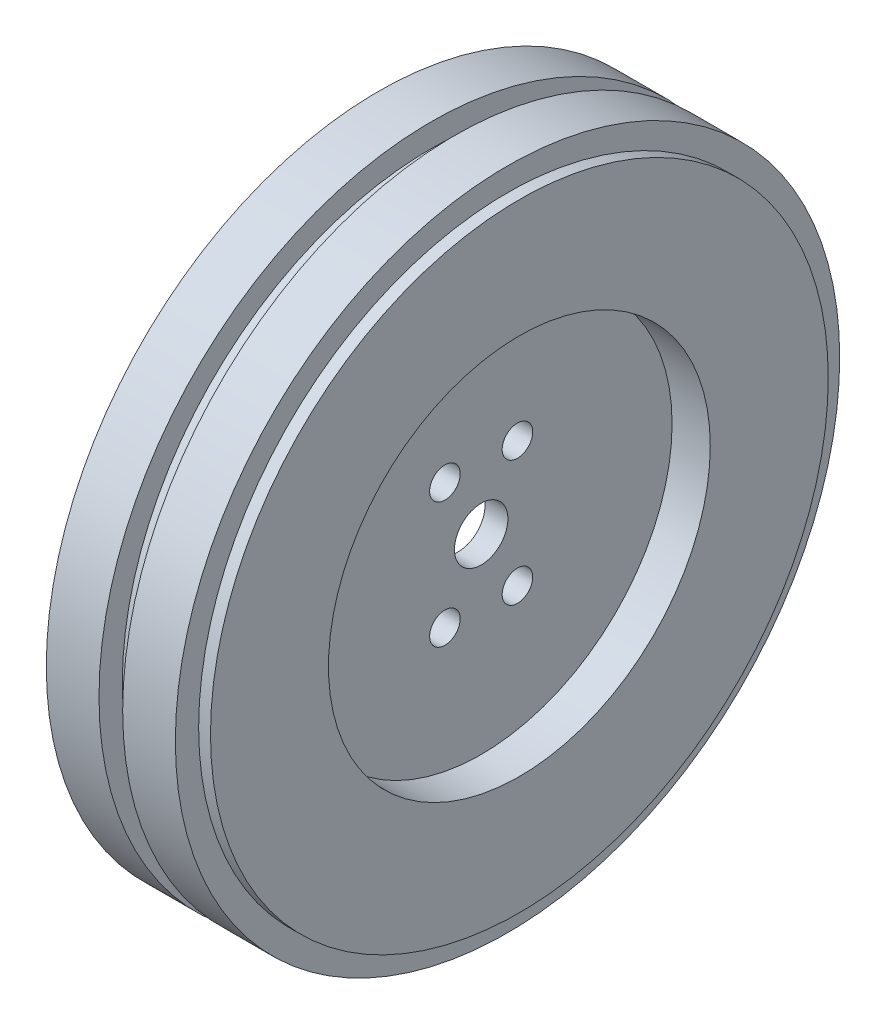
ISO-10303-21;
HEADER;
FILE_DESCRIPTION(('STEP AP214'),'2;1');
FILE_NAME('part.step','',(''),(''),'','','');
FILE_SCHEMA(('AUTOMOTIVE_DESIGN { 1 0 10303 214 1 1 1 1 }'));
ENDSEC;
DATA;
#1=APPLICATION_CONTEXT('core data for automotive mechanical design processes');
#2=APPLICATION_PROTOCOL_DEFINITION('international standard','automotive_design',2000,#1);
#3=PRODUCT_CONTEXT('',#1,'mechanical');
#4=PRODUCT('Part','Part','',(#3));
#5=PRODUCT_RELATED_PRODUCT_CATEGORY('part','',(#4));
#6=PRODUCT_DEFINITION_FORMATION('','',#4);
#7=PRODUCT_DEFINITION_CONTEXT('part definition',#1,'design');
#8=PRODUCT_DEFINITION('design','',#6,#7);
#9=PRODUCT_DEFINITION_SHAPE('','',#8);
#10=(LENGTH_UNIT() NAMED_UNIT(*) SI_UNIT(.MILLI.,.METRE.));
#11=(NAMED_UNIT(*) PLANE_ANGLE_UNIT() SI_UNIT($,.RADIAN.));
#12=(NAMED_UNIT(*) SI_UNIT($,.STERADIAN.) SOLID_ANGLE_UNIT());
#13=UNCERTAINTY_MEASURE_WITH_UNIT(LENGTH_MEASURE(1.E-05),#10,'distance_accuracy_value','');
#14=(GEOMETRIC_REPRESENTATION_CONTEXT(3) GLOBAL_UNCERTAINTY_ASSIGNED_CONTEXT((#13)) GLOBAL_UNIT_ASSIGNED_CONTEXT((#10,
#11,#12)) REPRESENTATION_CONTEXT('',''));
#15=CARTESIAN_POINT('',(0.,0.,0.));
#16=DIRECTION('',(0.,0.,1.));
#17=DIRECTION('',(1.,0.,0.));
#18=AXIS2_PLACEMENT_3D('',#15,#16,#17);
#19=CARTESIAN_POINT('',(8.00000000000001,0.,0.));
#20=DIRECTION('',(-1.,0.,0.));
#21=DIRECTION('',(0.,0.,1.));
#22=AXIS2_PLACEMENT_3D('',#19,#20,#21);
#23=CYLINDRICAL_SURFACE('',#22,43.5);
#24=CARTESIAN_POINT('',(-0.449999999999995,0.,0.));
#25=DIRECTION('',(-1.,0.,0.));
#26=DIRECTION('',(0.,0.,1.));
#27=AXIS2_PLACEMENT_3D('',#24,#25,#26);
#28=CIRCLE('',#27,43.5);
#29=CARTESIAN_POINT('',(-0.449999999999995,0.,43.5));
#30=VERTEX_POINT('',#29);
#31=EDGE_CURVE('E96',#30,#30,#28,.T.);
#32=ORIENTED_EDGE('',*,*,#31,.F.);
#33=EDGE_LOOP('',(#32));
#34=FACE_BOUND('',#33,.T.);
#35=CARTESIAN_POINT('',(6.45,0.,0.));
#36=DIRECTION('',(1.,0.,0.));
#37=DIRECTION('',(0.,0.,-1.));
#38=AXIS2_PLACEMENT_3D('',#35,#36,#37);
#39=CIRCLE('',#38,43.5);
#40=CARTESIAN_POINT('',(6.45,0.,-43.5));
#41=VERTEX_POINT('',#40);
#42=EDGE_CURVE('E102',#41,#41,#39,.T.);
#43=ORIENTED_EDGE('',*,*,#42,.F.);
#44=EDGE_LOOP('',(#43));
#45=FACE_BOUND('',#44,.T.);
#46=ADVANCED_FACE('F31',(#34,#45),#23,.T.);
#47=CARTESIAN_POINT('',(8.,40.,0.));
#48=DIRECTION('',(-1.,0.,0.));
#49=DIRECTION('',(0.,0.,1.));
#50=AXIS2_PLACEMENT_3D('',#47,#48,#49);
#51=PLANE('',#50);
#52=CARTESIAN_POINT('',(8.,0.,0.));
#53=DIRECTION('',(1.,0.,0.));
#54=DIRECTION('',(0.,0.,-1.));
#55=AXIS2_PLACEMENT_3D('',#52,#53,#54);
#56=CIRCLE('',#55,25.);
#57=CARTESIAN_POINT('',(8.,0.,-25.));
#58=VERTEX_POINT('',#57);
#59=EDGE_CURVE('E76',#58,#58,#56,.T.);
#60=ORIENTED_EDGE('',*,*,#59,.F.);
#61=EDGE_LOOP('',(#60));
#62=FACE_BOUND('',#61,.T.);
#63=CARTESIAN_POINT('',(8.,0.,0.));
#64=DIRECTION('',(1.,0.,0.));
#65=DIRECTION('',(0.,0.,-1.));
#66=AXIS2_PLACEMENT_3D('',#63,#64,#65);
#67=CIRCLE('',#66,40.45);
#68=CARTESIAN_POINT('',(8.,0.,-40.45));
#69=VERTEX_POINT('',#68);
#70=EDGE_CURVE('E106',#69,#69,#67,.T.);
#71=ORIENTED_EDGE('',*,*,#70,.T.);
#72=EDGE_LOOP('',(#71));
#73=FACE_BOUND('',#72,.T.);
#74=ADVANCED_FACE('F123',(#62,#73),#51,.F.);
#75=CARTESIAN_POINT('',(-12.,0.,0.));
#76=DIRECTION('',(-1.,0.,0.));
#77=DIRECTION('',(0.,0.,1.));
#78=AXIS2_PLACEMENT_3D('',#75,#76,#77);
#79=PLANE('',#78);
#80=CARTESIAN_POINT('',(-12.,0.,0.));
#81=DIRECTION('',(-1.,0.,0.));
#82=DIRECTION('',(0.,0.,1.));
#83=AXIS2_PLACEMENT_3D('',#80,#81,#82);
#84=CIRCLE('',#83,34.);
#85=CARTESIAN_POINT('',(-12.,0.,34.));
#86=VERTEX_POINT('',#85);
#87=EDGE_CURVE('E72',#86,#86,#84,.F.);
#88=ORIENTED_EDGE('',*,*,#87,.T.);
#89=EDGE_LOOP('',(#88));
#90=FACE_BOUND('',#89,.T.);
#91=CARTESIAN_POINT('',(-12.,0.,0.));
#92=DIRECTION('',(-1.,0.,0.));
#93=DIRECTION('',(0.,0.,1.));
#94=AXIS2_PLACEMENT_3D('',#91,#92,#93);
#95=CIRCLE('',#94,40.45);
#96=CARTESIAN_POINT('',(-12.,0.,40.45));
#97=VERTEX_POINT('',#96);
#98=EDGE_CURVE('E85',#97,#97,#95,.T.);
#99=ORIENTED_EDGE('',*,*,#98,.T.);
#100=EDGE_LOOP('',(#99));
#101=FACE_BOUND('',#100,.T.);
#102=ADVANCED_FACE('F130',(#90,#101),#79,.T.);
#103=CARTESIAN_POINT('',(-3.54999999999999,0.,0.));
#104=DIRECTION('',(-1.,0.,0.));
#105=DIRECTION('',(0.,0.,1.));
#106=AXIS2_PLACEMENT_3D('',#103,#104,#105);
#107=CIRCLE('',#106,43.5);
#108=CARTESIAN_POINT('',(-3.54999999999999,0.,43.5));
#109=VERTEX_POINT('',#108);
#110=EDGE_CURVE('E88',#109,#109,#107,.T.);
#111=ORIENTED_EDGE('',*,*,#110,.T.);
#112=EDGE_LOOP('',(#111));
#113=FACE_BOUND('',#112,.T.);
#114=CARTESIAN_POINT('',(-10.45,0.,0.));
#115=DIRECTION('',(-1.,0.,0.));
#116=DIRECTION('',(0.,0.,1.));
#117=AXIS2_PLACEMENT_3D('',#114,#115,#116);
#118=CIRCLE('',#117,43.5);
#119=CARTESIAN_POINT('',(-10.45,0.,43.5));
#120=VERTEX_POINT('',#119);
#121=EDGE_CURVE('E79',#120,#120,#118,.T.);
#122=ORIENTED_EDGE('',*,*,#121,.F.);
#123=EDGE_LOOP('',(#122));
#124=FACE_BOUND('',#123,.T.);
#125=ADVANCED_FACE('F126',(#113,#124),#23,.T.);
#126=CARTESIAN_POINT('',(-49.6444990272902,0.,0.));
#127=DIRECTION('',(-1.,0.,0.));
#128=DIRECTION('',(0.,0.,1.));
#129=AXIS2_PLACEMENT_3D('',#126,#127,#128);
#130=CYLINDRICAL_SURFACE('',#129,34.);
#131=CARTESIAN_POINT('',(0.,0.,0.));
#132=DIRECTION('',(-1.,0.,0.));
#133=DIRECTION('',(0.,0.,1.));
#134=AXIS2_PLACEMENT_3D('',#131,#132,#133);
#135=CIRCLE('',#134,34.);
#136=CARTESIAN_POINT('',(0.,0.,34.));
#137=VERTEX_POINT('',#136);
#138=EDGE_CURVE('E10',#137,#137,#135,.T.);
#139=ORIENTED_EDGE('',*,*,#138,.F.);
#140=EDGE_LOOP('',(#139));
#141=FACE_BOUND('',#140,.T.);
#142=ORIENTED_EDGE('',*,*,#87,.F.);
#143=EDGE_LOOP('',(#142));
#144=FACE_BOUND('',#143,.T.);
#145=ADVANCED_FACE('F33',(#141,#144),#130,.F.);
#146=CARTESIAN_POINT('',(0.,34.,0.));
#147=DIRECTION('',(1.,0.,0.));
#148=DIRECTION('',(0.,0.,-1.));
#149=AXIS2_PLACEMENT_3D('',#146,#147,#148);
#150=PLANE('',#149);
#151=CARTESIAN_POINT('',(0.,0.,0.));
#152=DIRECTION('',(1.,0.,0.));
#153=DIRECTION('',(0.,0.,-1.));
#154=AXIS2_PLACEMENT_3D('',#151,#152,#153);
#155=CIRCLE('',#154,3.5);
#156=CARTESIAN_POINT('',(0.,0.,-3.5));
#157=VERTEX_POINT('',#156);
#158=EDGE_CURVE('E66',#157,#157,#155,.T.);
#159=ORIENTED_EDGE('',*,*,#158,.T.);
#160=EDGE_LOOP('',(#159));
#161=FACE_BOUND('',#160,.T.);
#162=CARTESIAN_POINT('',(0.,8.22724133595216,4.75000000000001));
#163=DIRECTION('',(1.,0.,0.));
#164=DIRECTION('',(0.,0.,-1.));
#165=AXIS2_PLACEMENT_3D('',#162,#163,#164);
#166=CIRCLE('',#165,2.);
#167=CARTESIAN_POINT('',(0.,8.22724133595216,2.75000000000001));
#168=VERTEX_POINT('',#167);
#169=EDGE_CURVE('E38',#168,#168,#166,.T.);
#170=ORIENTED_EDGE('',*,*,#169,.T.);
#171=EDGE_LOOP('',(#170));
#172=FACE_BOUND('',#171,.T.);
#173=CARTESIAN_POINT('',(0.,-8.22724133595216,-4.75000000000001));
#174=DIRECTION('',(1.,0.,0.));
#175=DIRECTION('',(0.,0.,-1.));
#176=AXIS2_PLACEMENT_3D('',#173,#174,#175);
#177=CIRCLE('',#176,2.);
#178=CARTESIAN_POINT('',(0.,-8.22724133595216,-6.75000000000001));
#179=VERTEX_POINT('',#178);
#180=EDGE_CURVE('E42',#179,#179,#177,.T.);
#181=ORIENTED_EDGE('',*,*,#180,.T.);
#182=EDGE_LOOP('',(#181));
#183=FACE_BOUND('',#182,.T.);
#184=CARTESIAN_POINT('',(0.,-8.22724133595216,4.75000000000001));
#185=DIRECTION('',(1.,0.,0.));
#186=DIRECTION('',(0.,0.,-1.));
#187=AXIS2_PLACEMENT_3D('',#184,#185,#186);
#188=CIRCLE('',#187,2.);
#189=CARTESIAN_POINT('',(0.,-8.22724133595216,2.75000000000001));
#190=VERTEX_POINT('',#189);
#191=EDGE_CURVE('E46',#190,#190,#188,.T.);
#192=ORIENTED_EDGE('',*,*,#191,.T.);
#193=EDGE_LOOP('',(#192));
#194=FACE_BOUND('',#193,.T.);
#195=CARTESIAN_POINT('',(0.,8.22724133595216,-4.75000000000001));
#196=DIRECTION('',(1.,0.,0.));
#197=DIRECTION('',(0.,0.,-1.));
#198=AXIS2_PLACEMENT_3D('',#195,#196,#197);
#199=CIRCLE('',#198,2.);
#200=CARTESIAN_POINT('',(0.,8.22724133595216,-6.75000000000001));
#201=VERTEX_POINT('',#200);
#202=EDGE_CURVE('E51',#201,#201,#199,.T.);
#203=ORIENTED_EDGE('',*,*,#202,.T.);
#204=EDGE_LOOP('',(#203));
#205=FACE_BOUND('',#204,.T.);
#206=ORIENTED_EDGE('',*,*,#138,.T.);
#207=EDGE_LOOP('',(#206));
#208=FACE_BOUND('',#207,.T.);
#209=ADVANCED_FACE('F141',(#161,#172,#183,#194,#205,#208),#150,.F.);
#210=CARTESIAN_POINT('',(3.,12.5,0.));
#211=DIRECTION('',(1.,0.,0.));
#212=DIRECTION('',(0.,0.,-1.));
#213=AXIS2_PLACEMENT_3D('',#210,#211,#212);
#214=PLANE('',#213);
#215=CARTESIAN_POINT('',(3.,0.,0.));
#216=DIRECTION('',(1.,0.,0.));
#217=DIRECTION('',(0.,0.,-1.));
#218=AXIS2_PLACEMENT_3D('',#215,#216,#217);
#219=CIRCLE('',#218,3.5);
#220=CARTESIAN_POINT('',(3.,0.,-3.5));
#221=VERTEX_POINT('',#220);
#222=EDGE_CURVE('E69',#221,#221,#219,.T.);
#223=ORIENTED_EDGE('',*,*,#222,.F.);
#224=EDGE_LOOP('',(#223));
#225=FACE_BOUND('',#224,.T.);
#226=CARTESIAN_POINT('',(3.,8.22724133595216,4.75000000000001));
#227=DIRECTION('',(1.,0.,0.));
#228=DIRECTION('',(0.,0.,1.));
#229=AXIS2_PLACEMENT_3D('',#226,#227,#228);
#230=CIRCLE('',#229,2.);
#231=CARTESIAN_POINT('',(3.,8.22724133595216,6.75000000000001));
#232=VERTEX_POINT('',#231);
#233=EDGE_CURVE('E57',#232,#232,#230,.T.);
#234=ORIENTED_EDGE('',*,*,#233,.F.);
#235=EDGE_LOOP('',(#234));
#236=FACE_BOUND('',#235,.T.);
#237=CARTESIAN_POINT('',(3.,-8.22724133595216,-4.75000000000001));
#238=DIRECTION('',(1.,0.,0.));
#239=DIRECTION('',(0.,0.,1.));
#240=AXIS2_PLACEMENT_3D('',#237,#238,#239);
#241=CIRCLE('',#240,2.);
#242=CARTESIAN_POINT('',(3.,-8.22724133595216,-2.75000000000001));
#243=VERTEX_POINT('',#242);
#244=EDGE_CURVE('E58',#243,#243,#241,.T.);
#245=ORIENTED_EDGE('',*,*,#244,.F.);
#246=EDGE_LOOP('',(#245));
#247=FACE_BOUND('',#246,.T.);
#248=CARTESIAN_POINT('',(3.,-8.22724133595216,4.75000000000001));
#249=DIRECTION('',(1.,0.,0.));
#250=DIRECTION('',(0.,0.,-1.));
#251=AXIS2_PLACEMENT_3D('',#248,#249,#250);
#252=CIRCLE('',#251,2.);
#253=CARTESIAN_POINT('',(3.,-8.22724133595216,2.75000000000001));
#254=VERTEX_POINT('',#253);
#255=EDGE_CURVE('E61',#254,#254,#252,.T.);
#256=ORIENTED_EDGE('',*,*,#255,.F.);
#257=EDGE_LOOP('',(#256));
#258=FACE_BOUND('',#257,.T.);
#259=CARTESIAN_POINT('',(3.,8.22724133595216,-4.75000000000001));
#260=DIRECTION('',(1.,0.,0.));
#261=DIRECTION('',(0.,0.,-1.));
#262=AXIS2_PLACEMENT_3D('',#259,#260,#261);
#263=CIRCLE('',#262,2.);
#264=CARTESIAN_POINT('',(3.,8.22724133595216,-6.75000000000001));
#265=VERTEX_POINT('',#264);
#266=EDGE_CURVE('E54',#265,#265,#263,.T.);
#267=ORIENTED_EDGE('',*,*,#266,.F.);
#268=EDGE_LOOP('',(#267));
#269=FACE_BOUND('',#268,.T.);
#270=CARTESIAN_POINT('',(3.,0.,0.));
#271=DIRECTION('',(1.,0.,0.));
#272=DIRECTION('',(0.,0.,-1.));
#273=AXIS2_PLACEMENT_3D('',#270,#271,#272);
#274=CIRCLE('',#273,25.);
#275=CARTESIAN_POINT('',(3.,0.,-25.));
#276=VERTEX_POINT('',#275);
#277=EDGE_CURVE('E75',#276,#276,#274,.T.);
#278=ORIENTED_EDGE('',*,*,#277,.T.);
#279=EDGE_LOOP('',(#278));
#280=FACE_BOUND('',#279,.T.);
#281=ADVANCED_FACE('F232',(#225,#236,#247,#258,#269,#280),#214,.T.);
#282=CARTESIAN_POINT('',(-32.,8.22724133595216,-4.75000000000001));
#283=DIRECTION('',(1.,0.,0.));
#284=DIRECTION('',(0.,0.,-1.));
#285=AXIS2_PLACEMENT_3D('',#282,#283,#284);
#286=CYLINDRICAL_SURFACE('',#285,2.);
#287=ORIENTED_EDGE('',*,*,#266,.T.);
#288=EDGE_LOOP('',(#287));
#289=FACE_BOUND('',#288,.T.);
#290=ORIENTED_EDGE('',*,*,#202,.F.);
#291=EDGE_LOOP('',(#290));
#292=FACE_BOUND('',#291,.T.);
#293=ADVANCED_FACE('F236',(#289,#292),#286,.F.);
#294=CARTESIAN_POINT('',(-32.,-8.22724133595216,4.75000000000001));
#295=DIRECTION('',(1.,0.,0.));
#296=DIRECTION('',(0.,0.,-1.));
#297=AXIS2_PLACEMENT_3D('',#294,#295,#296);
#298=CYLINDRICAL_SURFACE('',#297,2.);
#299=ORIENTED_EDGE('',*,*,#255,.T.);
#300=EDGE_LOOP('',(#299));
#301=FACE_BOUND('',#300,.T.);
#302=ORIENTED_EDGE('',*,*,#191,.F.);
#303=EDGE_LOOP('',(#302));
#304=FACE_BOUND('',#303,.T.);
#305=ADVANCED_FACE('F282',(#301,#304),#298,.F.);
#306=CARTESIAN_POINT('',(-32.,-8.22724133595216,-4.75000000000001));
#307=DIRECTION('',(1.,0.,0.));
#308=DIRECTION('',(0.,0.,-1.));
#309=AXIS2_PLACEMENT_3D('',#306,#307,#308);
#310=CYLINDRICAL_SURFACE('',#309,2.);
#311=ORIENTED_EDGE('',*,*,#244,.T.);
#312=EDGE_LOOP('',(#311));
#313=FACE_BOUND('',#312,.T.);
#314=ORIENTED_EDGE('',*,*,#180,.F.);
#315=EDGE_LOOP('',(#314));
#316=FACE_BOUND('',#315,.T.);
#317=ADVANCED_FACE('F272',(#313,#316),#310,.F.);
#318=CARTESIAN_POINT('',(-32.,8.22724133595216,4.75000000000001));
#319=DIRECTION('',(1.,0.,0.));
#320=DIRECTION('',(0.,0.,-1.));
#321=AXIS2_PLACEMENT_3D('',#318,#319,#320);
#322=CYLINDRICAL_SURFACE('',#321,2.);
#323=ORIENTED_EDGE('',*,*,#233,.T.);
#324=EDGE_LOOP('',(#323));
#325=FACE_BOUND('',#324,.T.);
#326=ORIENTED_EDGE('',*,*,#169,.F.);
#327=EDGE_LOOP('',(#326));
#328=FACE_BOUND('',#327,.T.);
#329=ADVANCED_FACE('F254',(#325,#328),#322,.F.);
#330=CARTESIAN_POINT('',(-32.,0.,0.));
#331=DIRECTION('',(1.,0.,0.));
#332=DIRECTION('',(0.,0.,-1.));
#333=AXIS2_PLACEMENT_3D('',#330,#331,#332);
#334=CYLINDRICAL_SURFACE('',#333,3.5);
#335=ORIENTED_EDGE('',*,*,#222,.T.);
#336=EDGE_LOOP('',(#335));
#337=FACE_BOUND('',#336,.T.);
#338=ORIENTED_EDGE('',*,*,#158,.F.);
#339=EDGE_LOOP('',(#338));
#340=FACE_BOUND('',#339,.T.);
#341=ADVANCED_FACE('F161',(#337,#340),#334,.F.);
#342=CARTESIAN_POINT('',(3.,0.,0.));
#343=DIRECTION('',(1.,0.,0.));
#344=DIRECTION('',(0.,0.,-1.));
#345=AXIS2_PLACEMENT_3D('',#342,#343,#344);
#346=CYLINDRICAL_SURFACE('',#345,25.);
#347=ORIENTED_EDGE('',*,*,#277,.F.);
#348=EDGE_LOOP('',(#347));
#349=FACE_BOUND('',#348,.T.);
#350=ORIENTED_EDGE('',*,*,#59,.T.);
#351=EDGE_LOOP('',(#350));
#352=FACE_BOUND('',#351,.T.);
#353=ADVANCED_FACE('F152',(#349,#352),#346,.F.);
#354=CARTESIAN_POINT('',(-10.45,0.,0.));
#355=DIRECTION('',(-1.,0.,0.));
#356=DIRECTION('',(0.,0.,1.));
#357=AXIS2_PLACEMENT_3D('',#354,#355,#356);
#358=PLANE('',#357);
#359=CARTESIAN_POINT('',(-10.45,0.,0.));
#360=DIRECTION('',(-1.,0.,0.));
#361=DIRECTION('',(0.,0.,1.));
#362=AXIS2_PLACEMENT_3D('',#359,#360,#361);
#363=CIRCLE('',#362,40.45);
#364=CARTESIAN_POINT('',(-10.45,0.,40.45));
#365=VERTEX_POINT('',#364);
#366=EDGE_CURVE('E84',#365,#365,#363,.T.);
#367=ORIENTED_EDGE('',*,*,#366,.F.);
#368=EDGE_LOOP('',(#367));
#369=FACE_BOUND('',#368,.T.);
#370=ORIENTED_EDGE('',*,*,#121,.T.);
#371=EDGE_LOOP('',(#370));
#372=FACE_BOUND('',#371,.T.);
#373=ADVANCED_FACE('F149',(#369,#372),#358,.T.);
#374=CARTESIAN_POINT('',(-10.45,0.,0.));
#375=DIRECTION('',(-1.,0.,0.));
#376=DIRECTION('',(0.,0.,1.));
#377=AXIS2_PLACEMENT_3D('',#374,#375,#376);
#378=CYLINDRICAL_SURFACE('',#377,40.45);
#379=ORIENTED_EDGE('',*,*,#366,.T.);
#380=EDGE_LOOP('',(#379));
#381=FACE_BOUND('',#380,.T.);
#382=ORIENTED_EDGE('',*,*,#98,.F.);
#383=EDGE_LOOP('',(#382));
#384=FACE_BOUND('',#383,.T.);
#385=ADVANCED_FACE('F151',(#381,#384),#378,.T.);
#386=CARTESIAN_POINT('',(-3.54999999999999,0.,0.));
#387=DIRECTION('',(-1.,0.,0.));
#388=DIRECTION('',(0.,0.,1.));
#389=AXIS2_PLACEMENT_3D('',#386,#387,#388);
#390=PLANE('',#389);
#391=ORIENTED_EDGE('',*,*,#110,.F.);
#392=EDGE_LOOP('',(#391));
#393=FACE_BOUND('',#392,.T.);
#394=CARTESIAN_POINT('',(-3.54999999999999,0.,0.));
#395=DIRECTION('',(-1.,0.,0.));
#396=DIRECTION('',(0.,0.,1.));
#397=AXIS2_PLACEMENT_3D('',#394,#395,#396);
#398=CIRCLE('',#397,40.45);
#399=CARTESIAN_POINT('',(-3.54999999999999,0.,40.45));
#400=VERTEX_POINT('',#399);
#401=EDGE_CURVE('E93',#400,#400,#398,.T.);
#402=ORIENTED_EDGE('',*,*,#401,.T.);
#403=EDGE_LOOP('',(#402));
#404=FACE_BOUND('',#403,.T.);
#405=ADVANCED_FACE('F158',(#393,#404),#390,.F.);
#406=CARTESIAN_POINT('',(-3.54999999999999,0.,0.));
#407=DIRECTION('',(1.,0.,0.));
#408=DIRECTION('',(0.,0.,-1.));
#409=AXIS2_PLACEMENT_3D('',#406,#407,#408);
#410=CYLINDRICAL_SURFACE('',#409,40.45);
#411=ORIENTED_EDGE('',*,*,#401,.F.);
#412=EDGE_LOOP('',(#411));
#413=FACE_BOUND('',#412,.T.);
#414=CARTESIAN_POINT('',(-0.449999999999995,0.,0.));
#415=DIRECTION('',(-1.,0.,0.));
#416=DIRECTION('',(0.,0.,1.));
#417=AXIS2_PLACEMENT_3D('',#414,#415,#416);
#418=CIRCLE('',#417,40.45);
#419=CARTESIAN_POINT('',(-0.449999999999995,0.,40.45));
#420=VERTEX_POINT('',#419);
#421=EDGE_CURVE('E99',#420,#420,#418,.T.);
#422=ORIENTED_EDGE('',*,*,#421,.T.);
#423=EDGE_LOOP('',(#422));
#424=FACE_BOUND('',#423,.T.);
#425=ADVANCED_FACE('F167',(#413,#424),#410,.T.);
#426=CARTESIAN_POINT('',(-0.449999999999995,0.,0.));
#427=DIRECTION('',(-1.,0.,0.));
#428=DIRECTION('',(0.,0.,1.));
#429=AXIS2_PLACEMENT_3D('',#426,#427,#428);
#430=PLANE('',#429);
#431=ORIENTED_EDGE('',*,*,#421,.F.);
#432=EDGE_LOOP('',(#431));
#433=FACE_BOUND('',#432,.T.);
#434=ORIENTED_EDGE('',*,*,#31,.T.);
#435=EDGE_LOOP('',(#434));
#436=FACE_BOUND('',#435,.T.);
#437=ADVANCED_FACE('F118',(#433,#436),#430,.T.);
#438=CARTESIAN_POINT('',(6.45,0.,0.));
#439=DIRECTION('',(1.,0.,0.));
#440=DIRECTION('',(0.,0.,-1.));
#441=AXIS2_PLACEMENT_3D('',#438,#439,#440);
#442=PLANE('',#441);
#443=CARTESIAN_POINT('',(6.45,0.,0.));
#444=DIRECTION('',(1.,0.,0.));
#445=DIRECTION('',(0.,0.,-1.));
#446=AXIS2_PLACEMENT_3D('',#443,#444,#445);
#447=CIRCLE('',#446,40.45);
#448=CARTESIAN_POINT('',(6.45,0.,-40.45));
#449=VERTEX_POINT('',#448);
#450=EDGE_CURVE('E105',#449,#449,#447,.T.);
#451=ORIENTED_EDGE('',*,*,#450,.F.);
#452=EDGE_LOOP('',(#451));
#453=FACE_BOUND('',#452,.T.);
#454=ORIENTED_EDGE('',*,*,#42,.T.);
#455=EDGE_LOOP('',(#454));
#456=FACE_BOUND('',#455,.T.);
#457=ADVANCED_FACE('F115',(#453,#456),#442,.T.);
#458=CARTESIAN_POINT('',(6.45,0.,0.));
#459=DIRECTION('',(1.,0.,0.));
#460=DIRECTION('',(0.,0.,-1.));
#461=AXIS2_PLACEMENT_3D('',#458,#459,#460);
#462=CYLINDRICAL_SURFACE('',#461,40.45);
#463=ORIENTED_EDGE('',*,*,#450,.T.);
#464=EDGE_LOOP('',(#463));
#465=FACE_BOUND('',#464,.T.);
#466=ORIENTED_EDGE('',*,*,#70,.F.);
#467=EDGE_LOOP('',(#466));
#468=FACE_BOUND('',#467,.T.);
#469=ADVANCED_FACE('F112',(#465,#468),#462,.T.);
#470=CLOSED_SHELL('',(#46,#74,#102,#125,#145,#209,#281,#293,#305,#317,#329,#341,#353,#373,#385,
#405,#425,#437,#457,#469));
#471=MANIFOLD_SOLID_BREP('B2',#470);
#472=ADVANCED_BREP_SHAPE_REPRESENTATION('',(#18,#471),#14);
#473=SHAPE_DEFINITION_REPRESENTATION(#9,#472);
ENDSEC;
END-ISO-10303-21;
